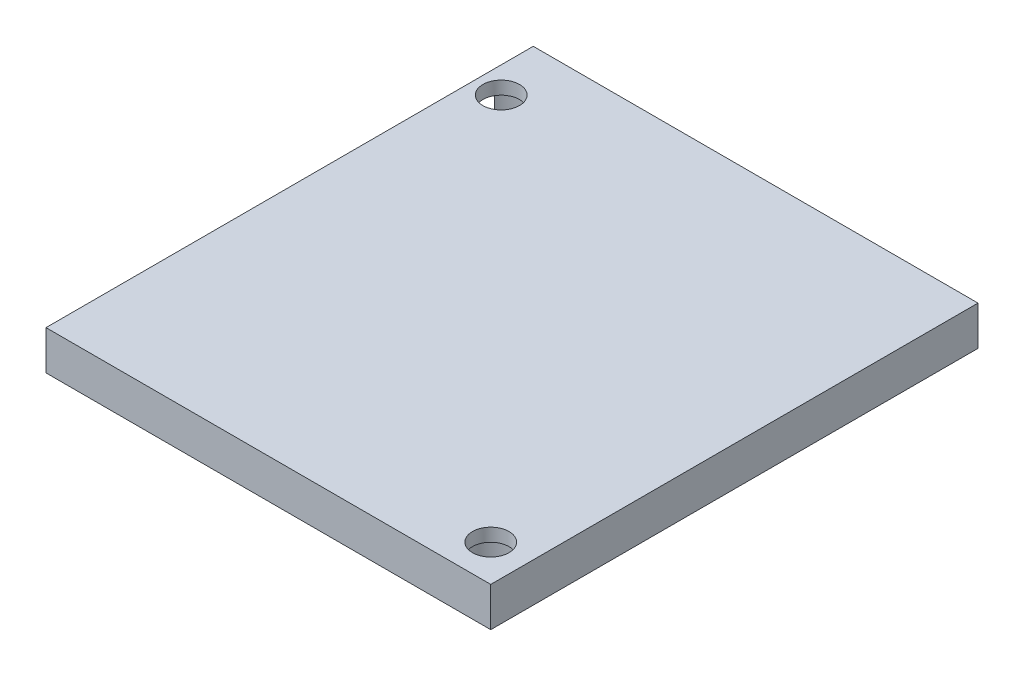
ISO-10303-21;
HEADER;
FILE_DESCRIPTION(('STEP AP214'),'2;1');
FILE_NAME('part.step','',(''),(''),'','','');
FILE_SCHEMA(('AUTOMOTIVE_DESIGN { 1 0 10303 214 1 1 1 1 }'));
ENDSEC;
DATA;
#1=APPLICATION_CONTEXT('core data for automotive mechanical design processes');
#2=APPLICATION_PROTOCOL_DEFINITION('international standard','automotive_design',2000,#1);
#3=PRODUCT_CONTEXT('',#1,'mechanical');
#4=PRODUCT('Part','Part','',(#3));
#5=PRODUCT_RELATED_PRODUCT_CATEGORY('part','',(#4));
#6=PRODUCT_DEFINITION_FORMATION('','',#4);
#7=PRODUCT_DEFINITION_CONTEXT('part definition',#1,'design');
#8=PRODUCT_DEFINITION('design','',#6,#7);
#9=PRODUCT_DEFINITION_SHAPE('','',#8);
#10=(LENGTH_UNIT() NAMED_UNIT(*) SI_UNIT(.MILLI.,.METRE.));
#11=(NAMED_UNIT(*) PLANE_ANGLE_UNIT() SI_UNIT($,.RADIAN.));
#12=(NAMED_UNIT(*) SI_UNIT($,.STERADIAN.) SOLID_ANGLE_UNIT());
#13=UNCERTAINTY_MEASURE_WITH_UNIT(LENGTH_MEASURE(1.E-05),#10,'distance_accuracy_value','');
#14=(GEOMETRIC_REPRESENTATION_CONTEXT(3) GLOBAL_UNCERTAINTY_ASSIGNED_CONTEXT((#13)) GLOBAL_UNIT_ASSIGNED_CONTEXT((#10,
#11,#12)) REPRESENTATION_CONTEXT('',''));
#15=CARTESIAN_POINT('',(0.,0.,0.));
#16=DIRECTION('',(0.,0.,1.));
#17=DIRECTION('',(1.,0.,0.));
#18=AXIS2_PLACEMENT_3D('',#15,#16,#17);
#19=CARTESIAN_POINT('',(17.,-3.,18.625));
#20=DIRECTION('',(-1.,0.,0.));
#21=DIRECTION('',(0.,0.,1.));
#22=AXIS2_PLACEMENT_3D('',#19,#20,#21);
#23=PLANE('',#22);
#24=DIRECTION('',(0.,0.,-1.));
#25=VECTOR('',#24,1.);
#26=CARTESIAN_POINT('',(17.,0.,18.625));
#27=LINE('',#26,#25);
#28=CARTESIAN_POINT('',(17.,0.,18.625));
#29=VERTEX_POINT('',#28);
#30=CARTESIAN_POINT('',(17.,0.,-18.625));
#31=VERTEX_POINT('',#30);
#32=EDGE_CURVE('E124',#29,#31,#27,.T.);
#33=ORIENTED_EDGE('',*,*,#32,.F.);
#34=DIRECTION('',(0.,1.,0.));
#35=VECTOR('',#34,1.);
#36=CARTESIAN_POINT('',(17.,-3.,18.625));
#37=LINE('',#36,#35);
#38=CARTESIAN_POINT('',(17.,-3.,18.625));
#39=VERTEX_POINT('',#38);
#40=EDGE_CURVE('E153',#39,#29,#37,.T.);
#41=ORIENTED_EDGE('',*,*,#40,.F.);
#42=DIRECTION('',(0.,0.,-1.));
#43=VECTOR('',#42,1.);
#44=CARTESIAN_POINT('',(17.,-3.,18.625));
#45=LINE('',#44,#43);
#46=CARTESIAN_POINT('',(17.,-3.,-18.625));
#47=VERTEX_POINT('',#46);
#48=EDGE_CURVE('E169',#39,#47,#45,.T.);
#49=ORIENTED_EDGE('',*,*,#48,.T.);
#50=DIRECTION('',(0.,1.,0.));
#51=VECTOR('',#50,1.);
#52=CARTESIAN_POINT('',(17.,-3.,-18.625));
#53=LINE('',#52,#51);
#54=EDGE_CURVE('E154',#47,#31,#53,.T.);
#55=ORIENTED_EDGE('',*,*,#54,.T.);
#56=EDGE_LOOP('',(#33,#41,#49,#55));
#57=FACE_BOUND('',#56,.T.);
#58=ADVANCED_FACE('F47',(#57),#23,.F.);
#59=CARTESIAN_POINT('',(-17.,-3.,-18.625));
#60=DIRECTION('',(0.,0.,1.));
#61=DIRECTION('',(1.,0.,0.));
#62=AXIS2_PLACEMENT_3D('',#59,#60,#61);
#63=PLANE('',#62);
#64=DIRECTION('',(-1.,0.,0.));
#65=VECTOR('',#64,1.);
#66=CARTESIAN_POINT('',(-17.,0.,-18.625));
#67=LINE('',#66,#65);
#68=CARTESIAN_POINT('',(-17.,0.,-18.625));
#69=VERTEX_POINT('',#68);
#70=EDGE_CURVE('E157',#31,#69,#67,.T.);
#71=ORIENTED_EDGE('',*,*,#70,.F.);
#72=ORIENTED_EDGE('',*,*,#54,.F.);
#73=DIRECTION('',(-1.,0.,0.));
#74=VECTOR('',#73,1.);
#75=CARTESIAN_POINT('',(-17.,-3.,-18.625));
#76=LINE('',#75,#74);
#77=CARTESIAN_POINT('',(-17.,-3.,-18.625));
#78=VERTEX_POINT('',#77);
#79=EDGE_CURVE('E98',#47,#78,#76,.T.);
#80=ORIENTED_EDGE('',*,*,#79,.T.);
#81=DIRECTION('',(0.,1.,0.));
#82=VECTOR('',#81,1.);
#83=CARTESIAN_POINT('',(-17.,-3.,-18.625));
#84=LINE('',#83,#82);
#85=EDGE_CURVE('E176',#78,#69,#84,.T.);
#86=ORIENTED_EDGE('',*,*,#85,.T.);
#87=EDGE_LOOP('',(#71,#72,#80,#86));
#88=FACE_BOUND('',#87,.T.);
#89=ADVANCED_FACE('F143',(#88),#63,.F.);
#90=CARTESIAN_POINT('',(-17.,-3.,18.625));
#91=DIRECTION('',(1.,0.,0.));
#92=DIRECTION('',(0.,0.,-1.));
#93=AXIS2_PLACEMENT_3D('',#90,#91,#92);
#94=PLANE('',#93);
#95=DIRECTION('',(0.,0.,1.));
#96=VECTOR('',#95,1.);
#97=CARTESIAN_POINT('',(-17.,-1.,18.625));
#98=LINE('',#97,#96);
#99=CARTESIAN_POINT('',(-17.,-1.,-15.675));
#100=VERTEX_POINT('',#99);
#101=CARTESIAN_POINT('',(-17.,-1.,-12.675));
#102=VERTEX_POINT('',#101);
#103=EDGE_CURVE('E11',#100,#102,#98,.T.);
#104=ORIENTED_EDGE('',*,*,#103,.T.);
#105=DIRECTION('',(0.,-1.,0.));
#106=VECTOR('',#105,1.);
#107=CARTESIAN_POINT('',(-17.,-1.,-12.675));
#108=LINE('',#107,#106);
#109=CARTESIAN_POINT('',(-17.,-3.,-12.675));
#110=VERTEX_POINT('',#109);
#111=EDGE_CURVE('E113',#110,#102,#108,.F.);
#112=ORIENTED_EDGE('',*,*,#111,.F.);
#113=DIRECTION('',(0.,0.,1.));
#114=VECTOR('',#113,1.);
#115=CARTESIAN_POINT('',(-17.,-3.,18.625));
#116=LINE('',#115,#114);
#117=CARTESIAN_POINT('',(-17.,-3.,18.625));
#118=VERTEX_POINT('',#117);
#119=EDGE_CURVE('E186',#110,#118,#116,.T.);
#120=ORIENTED_EDGE('',*,*,#119,.T.);
#121=DIRECTION('',(0.,1.,0.));
#122=VECTOR('',#121,1.);
#123=CARTESIAN_POINT('',(-17.,-3.,18.625));
#124=LINE('',#123,#122);
#125=CARTESIAN_POINT('',(-17.,0.,18.625));
#126=VERTEX_POINT('',#125);
#127=EDGE_CURVE('E172',#118,#126,#124,.T.);
#128=ORIENTED_EDGE('',*,*,#127,.T.);
#129=DIRECTION('',(0.,0.,1.));
#130=VECTOR('',#129,1.);
#131=CARTESIAN_POINT('',(-17.,0.,18.625));
#132=LINE('',#131,#130);
#133=EDGE_CURVE('E160',#69,#126,#132,.T.);
#134=ORIENTED_EDGE('',*,*,#133,.F.);
#135=ORIENTED_EDGE('',*,*,#85,.F.);
#136=CARTESIAN_POINT('',(-17.,-3.,-15.675));
#137=VERTEX_POINT('',#136);
#138=EDGE_CURVE('E122',#78,#137,#116,.T.);
#139=ORIENTED_EDGE('',*,*,#138,.T.);
#140=DIRECTION('',(0.,-1.,0.));
#141=VECTOR('',#140,1.);
#142=CARTESIAN_POINT('',(-17.,-1.,-15.675));
#143=LINE('',#142,#141);
#144=EDGE_CURVE('E110',#100,#137,#143,.T.);
#145=ORIENTED_EDGE('',*,*,#144,.F.);
#146=EDGE_LOOP('',(#104,#112,#120,#128,#134,#135,#139,#145));
#147=FACE_BOUND('',#146,.T.);
#148=ADVANCED_FACE('F120',(#147),#94,.F.);
#149=CARTESIAN_POINT('',(-17.,-3.,18.625));
#150=DIRECTION('',(0.,0.,-1.));
#151=DIRECTION('',(-1.,0.,0.));
#152=AXIS2_PLACEMENT_3D('',#149,#150,#151);
#153=PLANE('',#152);
#154=DIRECTION('',(1.,0.,0.));
#155=VECTOR('',#154,1.);
#156=CARTESIAN_POINT('',(-17.,0.,18.625));
#157=LINE('',#156,#155);
#158=EDGE_CURVE('E92',#126,#29,#157,.T.);
#159=ORIENTED_EDGE('',*,*,#158,.F.);
#160=ORIENTED_EDGE('',*,*,#127,.F.);
#161=DIRECTION('',(1.,0.,0.));
#162=VECTOR('',#161,1.);
#163=CARTESIAN_POINT('',(-17.,-3.,18.625));
#164=LINE('',#163,#162);
#165=EDGE_CURVE('E71',#118,#39,#164,.T.);
#166=ORIENTED_EDGE('',*,*,#165,.T.);
#167=ORIENTED_EDGE('',*,*,#40,.T.);
#168=EDGE_LOOP('',(#159,#160,#166,#167));
#169=FACE_BOUND('',#168,.T.);
#170=ADVANCED_FACE('F243',(#169),#153,.F.);
#171=CARTESIAN_POINT('',(0.,-3.,0.));
#172=DIRECTION('',(0.,1.,0.));
#173=DIRECTION('',(0.,0.,-1.));
#174=AXIS2_PLACEMENT_3D('',#171,#172,#173);
#175=PLANE('',#174);
#176=CARTESIAN_POINT('',(14.2,-3.,15.825));
#177=DIRECTION('',(0.,1.,0.));
#178=DIRECTION('',(0.,0.,1.));
#179=AXIS2_PLACEMENT_3D('',#176,#177,#178);
#180=CIRCLE('',#179,2.5);
#181=CARTESIAN_POINT('',(14.2,-3.,18.325));
#182=VERTEX_POINT('',#181);
#183=EDGE_CURVE('E117',#182,#182,#180,.T.);
#184=ORIENTED_EDGE('',*,*,#183,.T.);
#185=EDGE_LOOP('',(#184));
#186=FACE_BOUND('',#185,.T.);
#187=ORIENTED_EDGE('',*,*,#138,.F.);
#188=ORIENTED_EDGE('',*,*,#79,.F.);
#189=ORIENTED_EDGE('',*,*,#48,.F.);
#190=ORIENTED_EDGE('',*,*,#165,.F.);
#191=ORIENTED_EDGE('',*,*,#119,.F.);
#192=CARTESIAN_POINT('',(-15.,-3.,-14.175));
#193=DIRECTION('',(0.,-1.,0.));
#194=DIRECTION('',(0.,0.,-1.));
#195=AXIS2_PLACEMENT_3D('',#192,#193,#194);
#196=CIRCLE('',#195,2.5);
#197=EDGE_CURVE('E56',#137,#110,#196,.T.);
#198=ORIENTED_EDGE('',*,*,#197,.F.);
#199=EDGE_LOOP('',(#187,#188,#189,#190,#191,#198));
#200=FACE_BOUND('',#199,.T.);
#201=ADVANCED_FACE('F227',(#186,#200),#175,.F.);
#202=CARTESIAN_POINT('',(0.,0.,0.));
#203=DIRECTION('',(0.,1.,0.));
#204=DIRECTION('',(0.,0.,-1.));
#205=AXIS2_PLACEMENT_3D('',#202,#203,#204);
#206=PLANE('',#205);
#207=CARTESIAN_POINT('',(-15.,0.,-14.175));
#208=DIRECTION('',(0.,-1.,0.));
#209=DIRECTION('',(0.,0.,-1.));
#210=AXIS2_PLACEMENT_3D('',#207,#208,#209);
#211=CIRCLE('',#210,1.4);
#212=CARTESIAN_POINT('',(-15.,0.,-15.575));
#213=VERTEX_POINT('',#212);
#214=EDGE_CURVE('E202',#213,#213,#211,.T.);
#215=ORIENTED_EDGE('',*,*,#214,.T.);
#216=EDGE_LOOP('',(#215));
#217=FACE_BOUND('',#216,.T.);
#218=CARTESIAN_POINT('',(14.2,0.,15.825));
#219=DIRECTION('',(0.,-1.,0.));
#220=DIRECTION('',(0.,0.,-1.));
#221=AXIS2_PLACEMENT_3D('',#218,#219,#220);
#222=CIRCLE('',#221,1.4);
#223=CARTESIAN_POINT('',(14.2,0.,14.425));
#224=VERTEX_POINT('',#223);
#225=EDGE_CURVE('E50',#224,#224,#222,.T.);
#226=ORIENTED_EDGE('',*,*,#225,.T.);
#227=EDGE_LOOP('',(#226));
#228=FACE_BOUND('',#227,.T.);
#229=ORIENTED_EDGE('',*,*,#32,.T.);
#230=ORIENTED_EDGE('',*,*,#70,.T.);
#231=ORIENTED_EDGE('',*,*,#133,.T.);
#232=ORIENTED_EDGE('',*,*,#158,.T.);
#233=EDGE_LOOP('',(#229,#230,#231,#232));
#234=FACE_BOUND('',#233,.T.);
#235=ADVANCED_FACE('F224',(#217,#228,#234),#206,.T.);
#236=CARTESIAN_POINT('',(14.2,-1.,15.825));
#237=DIRECTION('',(0.,-1.,0.));
#238=DIRECTION('',(0.,0.,1.));
#239=AXIS2_PLACEMENT_3D('',#236,#237,#238);
#240=CYLINDRICAL_SURFACE('',#239,2.5);
#241=CARTESIAN_POINT('',(14.2,-1.,15.825));
#242=DIRECTION('',(0.,1.,0.));
#243=DIRECTION('',(0.,0.,1.));
#244=AXIS2_PLACEMENT_3D('',#241,#242,#243);
#245=CIRCLE('',#244,2.5);
#246=CARTESIAN_POINT('',(14.2,-1.,18.325));
#247=VERTEX_POINT('',#246);
#248=EDGE_CURVE('E195',#247,#247,#245,.T.);
#249=ORIENTED_EDGE('',*,*,#248,.T.);
#250=EDGE_LOOP('',(#249));
#251=FACE_BOUND('',#250,.T.);
#252=ORIENTED_EDGE('',*,*,#183,.F.);
#253=EDGE_LOOP('',(#252));
#254=FACE_BOUND('',#253,.T.);
#255=ADVANCED_FACE('F137',(#251,#254),#240,.F.);
#256=CARTESIAN_POINT('',(14.2,-1.,15.825));
#257=DIRECTION('',(0.,-1.,0.));
#258=DIRECTION('',(0.,0.,1.));
#259=AXIS2_PLACEMENT_3D('',#256,#257,#258);
#260=PLANE('',#259);
#261=CARTESIAN_POINT('',(14.2,-1.,15.825));
#262=DIRECTION('',(0.,1.,0.));
#263=DIRECTION('',(0.,0.,1.));
#264=AXIS2_PLACEMENT_3D('',#261,#262,#263);
#265=CIRCLE('',#264,1.4);
#266=CARTESIAN_POINT('',(14.2,-1.,17.225));
#267=VERTEX_POINT('',#266);
#268=EDGE_CURVE('E207',#267,#267,#265,.T.);
#269=ORIENTED_EDGE('',*,*,#268,.T.);
#270=EDGE_LOOP('',(#269));
#271=FACE_BOUND('',#270,.T.);
#272=ORIENTED_EDGE('',*,*,#248,.F.);
#273=EDGE_LOOP('',(#272));
#274=FACE_BOUND('',#273,.T.);
#275=ADVANCED_FACE('F128',(#271,#274),#260,.T.);
#276=CARTESIAN_POINT('',(-15.,-1.,-14.175));
#277=DIRECTION('',(0.,-1.,0.));
#278=DIRECTION('',(0.,0.,1.));
#279=AXIS2_PLACEMENT_3D('',#276,#277,#278);
#280=PLANE('',#279);
#281=CARTESIAN_POINT('',(-15.,-1.,-14.175));
#282=DIRECTION('',(0.,1.,0.));
#283=DIRECTION('',(0.,0.,1.));
#284=AXIS2_PLACEMENT_3D('',#281,#282,#283);
#285=CIRCLE('',#284,1.4);
#286=CARTESIAN_POINT('',(-15.,-1.,-12.775));
#287=VERTEX_POINT('',#286);
#288=EDGE_CURVE('E206',#287,#287,#285,.T.);
#289=ORIENTED_EDGE('',*,*,#288,.T.);
#290=EDGE_LOOP('',(#289));
#291=FACE_BOUND('',#290,.T.);
#292=ORIENTED_EDGE('',*,*,#103,.F.);
#293=CARTESIAN_POINT('',(-15.,-1.,-14.175));
#294=DIRECTION('',(0.,1.,0.));
#295=DIRECTION('',(0.,0.,1.));
#296=AXIS2_PLACEMENT_3D('',#293,#294,#295);
#297=CIRCLE('',#296,2.5);
#298=EDGE_CURVE('E107',#102,#100,#297,.T.);
#299=ORIENTED_EDGE('',*,*,#298,.F.);
#300=EDGE_LOOP('',(#292,#299));
#301=FACE_BOUND('',#300,.T.);
#302=ADVANCED_FACE('F126',(#291,#301),#280,.T.);
#303=CARTESIAN_POINT('',(-15.,-1.,-14.175));
#304=DIRECTION('',(0.,-1.,0.));
#305=DIRECTION('',(0.,0.,1.));
#306=AXIS2_PLACEMENT_3D('',#303,#304,#305);
#307=CYLINDRICAL_SURFACE('',#306,2.5);
#308=ORIENTED_EDGE('',*,*,#298,.T.);
#309=ORIENTED_EDGE('',*,*,#144,.T.);
#310=ORIENTED_EDGE('',*,*,#197,.T.);
#311=ORIENTED_EDGE('',*,*,#111,.T.);
#312=EDGE_LOOP('',(#308,#309,#310,#311));
#313=FACE_BOUND('',#312,.T.);
#314=ADVANCED_FACE('F109',(#313),#307,.F.);
#315=CARTESIAN_POINT('',(-15.,1.,-14.175));
#316=DIRECTION('',(0.,-1.,0.));
#317=DIRECTION('',(0.,0.,1.));
#318=AXIS2_PLACEMENT_3D('',#315,#316,#317);
#319=CYLINDRICAL_SURFACE('',#318,1.4);
#320=ORIENTED_EDGE('',*,*,#214,.F.);
#321=EDGE_LOOP('',(#320));
#322=FACE_BOUND('',#321,.T.);
#323=ORIENTED_EDGE('',*,*,#288,.F.);
#324=EDGE_LOOP('',(#323));
#325=FACE_BOUND('',#324,.T.);
#326=ADVANCED_FACE('F135',(#322,#325),#319,.F.);
#327=CARTESIAN_POINT('',(14.2,1.,15.825));
#328=DIRECTION('',(0.,-1.,0.));
#329=DIRECTION('',(0.,0.,1.));
#330=AXIS2_PLACEMENT_3D('',#327,#328,#329);
#331=CYLINDRICAL_SURFACE('',#330,1.4);
#332=ORIENTED_EDGE('',*,*,#225,.F.);
#333=EDGE_LOOP('',(#332));
#334=FACE_BOUND('',#333,.T.);
#335=ORIENTED_EDGE('',*,*,#268,.F.);
#336=EDGE_LOOP('',(#335));
#337=FACE_BOUND('',#336,.T.);
#338=ADVANCED_FACE('F215',(#334,#337),#331,.F.);
#339=CLOSED_SHELL('',(#58,#89,#148,#170,#201,#235,#255,#275,#302,#314,#326,#338));
#340=MANIFOLD_SOLID_BREP('B2',#339);
#341=ADVANCED_BREP_SHAPE_REPRESENTATION('',(#18,#340),#14);
#342=SHAPE_DEFINITION_REPRESENTATION(#9,#341);
ENDSEC;
END-ISO-10303-21;
